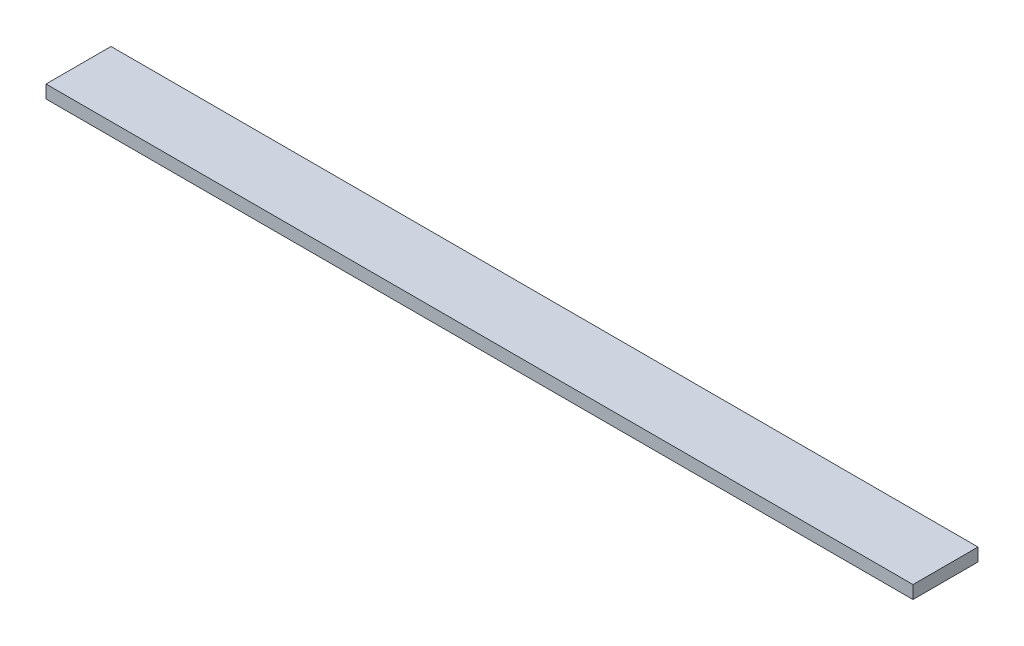
ISO-10303-21;
HEADER;
FILE_DESCRIPTION(('STEP AP214'),'2;1');
FILE_NAME('part.step','',(''),(''),'','','');
FILE_SCHEMA(('AUTOMOTIVE_DESIGN { 1 0 10303 214 1 1 1 1 }'));
ENDSEC;
DATA;
#1=APPLICATION_CONTEXT('core data for automotive mechanical design processes');
#2=APPLICATION_PROTOCOL_DEFINITION('international standard','automotive_design',2000,#1);
#3=PRODUCT_CONTEXT('',#1,'mechanical');
#4=PRODUCT('Part','Part','',(#3));
#5=PRODUCT_RELATED_PRODUCT_CATEGORY('part','',(#4));
#6=PRODUCT_DEFINITION_FORMATION('','',#4);
#7=PRODUCT_DEFINITION_CONTEXT('part definition',#1,'design');
#8=PRODUCT_DEFINITION('design','',#6,#7);
#9=PRODUCT_DEFINITION_SHAPE('','',#8);
#10=(LENGTH_UNIT() NAMED_UNIT(*) SI_UNIT(.MILLI.,.METRE.));
#11=(NAMED_UNIT(*) PLANE_ANGLE_UNIT() SI_UNIT($,.RADIAN.));
#12=(NAMED_UNIT(*) SI_UNIT($,.STERADIAN.) SOLID_ANGLE_UNIT());
#13=UNCERTAINTY_MEASURE_WITH_UNIT(LENGTH_MEASURE(1.E-05),#10,'distance_accuracy_value','');
#14=(GEOMETRIC_REPRESENTATION_CONTEXT(3) GLOBAL_UNCERTAINTY_ASSIGNED_CONTEXT((#13)) GLOBAL_UNIT_ASSIGNED_CONTEXT((#10,
#11,#12)) REPRESENTATION_CONTEXT('',''));
#15=CARTESIAN_POINT('',(0.,0.,0.));
#16=DIRECTION('',(0.,0.,1.));
#17=DIRECTION('',(1.,0.,0.));
#18=AXIS2_PLACEMENT_3D('',#15,#16,#17);
#19=CARTESIAN_POINT('',(200.,-1.5,-7.5));
#20=DIRECTION('',(0.,0.,1.));
#21=DIRECTION('',(1.,0.,0.));
#22=AXIS2_PLACEMENT_3D('',#19,#20,#21);
#23=PLANE('',#22);
#24=DIRECTION('',(0.,1.,0.));
#25=VECTOR('',#24,1.);
#26=CARTESIAN_POINT('',(0.,-1.5,-7.5));
#27=LINE('',#26,#25);
#28=CARTESIAN_POINT('',(0.,-1.5,-7.5));
#29=VERTEX_POINT('',#28);
#30=CARTESIAN_POINT('',(0.,1.5,-7.5));
#31=VERTEX_POINT('',#30);
#32=EDGE_CURVE('E98',#29,#31,#27,.T.);
#33=ORIENTED_EDGE('',*,*,#32,.T.);
#34=DIRECTION('',(-1.,0.,0.));
#35=VECTOR('',#34,1.);
#36=CARTESIAN_POINT('',(200.,1.5,-7.5));
#37=LINE('',#36,#35);
#38=CARTESIAN_POINT('',(200.,1.5,-7.5));
#39=VERTEX_POINT('',#38);
#40=EDGE_CURVE('E11',#39,#31,#37,.T.);
#41=ORIENTED_EDGE('',*,*,#40,.F.);
#42=DIRECTION('',(0.,1.,0.));
#43=VECTOR('',#42,1.);
#44=CARTESIAN_POINT('',(200.,-1.5,-7.5));
#45=LINE('',#44,#43);
#46=CARTESIAN_POINT('',(200.,-1.5,-7.5));
#47=VERTEX_POINT('',#46);
#48=EDGE_CURVE('E86',#47,#39,#45,.T.);
#49=ORIENTED_EDGE('',*,*,#48,.F.);
#50=DIRECTION('',(-1.,0.,0.));
#51=VECTOR('',#50,1.);
#52=CARTESIAN_POINT('',(200.,-1.5,-7.5));
#53=LINE('',#52,#51);
#54=EDGE_CURVE('E94',#47,#29,#53,.T.);
#55=ORIENTED_EDGE('',*,*,#54,.T.);
#56=EDGE_LOOP('',(#33,#41,#49,#55));
#57=FACE_BOUND('',#56,.T.);
#58=ADVANCED_FACE('F35',(#57),#23,.F.);
#59=CARTESIAN_POINT('',(200.,1.5,7.5));
#60=DIRECTION('',(0.,-1.,0.));
#61=DIRECTION('',(0.,0.,-1.));
#62=AXIS2_PLACEMENT_3D('',#59,#60,#61);
#63=PLANE('',#62);
#64=DIRECTION('',(0.,0.,1.));
#65=VECTOR('',#64,1.);
#66=CARTESIAN_POINT('',(0.,1.5,7.5));
#67=LINE('',#66,#65);
#68=CARTESIAN_POINT('',(0.,1.5,7.5));
#69=VERTEX_POINT('',#68);
#70=EDGE_CURVE('E90',#31,#69,#67,.T.);
#71=ORIENTED_EDGE('',*,*,#70,.T.);
#72=DIRECTION('',(-1.,0.,0.));
#73=VECTOR('',#72,1.);
#74=CARTESIAN_POINT('',(200.,1.5,7.5));
#75=LINE('',#74,#73);
#76=CARTESIAN_POINT('',(200.,1.5,7.5));
#77=VERTEX_POINT('',#76);
#78=EDGE_CURVE('E43',#77,#69,#75,.T.);
#79=ORIENTED_EDGE('',*,*,#78,.F.);
#80=DIRECTION('',(0.,0.,1.));
#81=VECTOR('',#80,1.);
#82=CARTESIAN_POINT('',(200.,1.5,7.5));
#83=LINE('',#82,#81);
#84=EDGE_CURVE('E81',#39,#77,#83,.T.);
#85=ORIENTED_EDGE('',*,*,#84,.F.);
#86=ORIENTED_EDGE('',*,*,#40,.T.);
#87=EDGE_LOOP('',(#71,#79,#85,#86));
#88=FACE_BOUND('',#87,.T.);
#89=ADVANCED_FACE('F89',(#88),#63,.F.);
#90=CARTESIAN_POINT('',(200.,-1.5,7.5));
#91=DIRECTION('',(0.,0.,-1.));
#92=DIRECTION('',(-1.,0.,0.));
#93=AXIS2_PLACEMENT_3D('',#90,#91,#92);
#94=PLANE('',#93);
#95=DIRECTION('',(0.,-1.,0.));
#96=VECTOR('',#95,1.);
#97=CARTESIAN_POINT('',(0.,-1.5,7.5));
#98=LINE('',#97,#96);
#99=CARTESIAN_POINT('',(0.,-1.5,7.5));
#100=VERTEX_POINT('',#99);
#101=EDGE_CURVE('E68',#69,#100,#98,.T.);
#102=ORIENTED_EDGE('',*,*,#101,.T.);
#103=DIRECTION('',(-1.,0.,0.));
#104=VECTOR('',#103,1.);
#105=CARTESIAN_POINT('',(200.,-1.5,7.5));
#106=LINE('',#105,#104);
#107=CARTESIAN_POINT('',(200.,-1.5,7.5));
#108=VERTEX_POINT('',#107);
#109=EDGE_CURVE('E91',#108,#100,#106,.T.);
#110=ORIENTED_EDGE('',*,*,#109,.F.);
#111=DIRECTION('',(0.,-1.,0.));
#112=VECTOR('',#111,1.);
#113=CARTESIAN_POINT('',(200.,-1.5,7.5));
#114=LINE('',#113,#112);
#115=EDGE_CURVE('E84',#77,#108,#114,.T.);
#116=ORIENTED_EDGE('',*,*,#115,.F.);
#117=ORIENTED_EDGE('',*,*,#78,.T.);
#118=EDGE_LOOP('',(#102,#110,#116,#117));
#119=FACE_BOUND('',#118,.T.);
#120=ADVANCED_FACE('F92',(#119),#94,.F.);
#121=CARTESIAN_POINT('',(200.,-1.5,7.5));
#122=DIRECTION('',(0.,1.,0.));
#123=DIRECTION('',(0.,0.,1.));
#124=AXIS2_PLACEMENT_3D('',#121,#122,#123);
#125=PLANE('',#124);
#126=DIRECTION('',(0.,0.,-1.));
#127=VECTOR('',#126,1.);
#128=CARTESIAN_POINT('',(0.,-1.5,7.5));
#129=LINE('',#128,#127);
#130=EDGE_CURVE('E74',#100,#29,#129,.T.);
#131=ORIENTED_EDGE('',*,*,#130,.T.);
#132=ORIENTED_EDGE('',*,*,#54,.F.);
#133=DIRECTION('',(0.,0.,-1.));
#134=VECTOR('',#133,1.);
#135=CARTESIAN_POINT('',(200.,-1.5,7.5));
#136=LINE('',#135,#134);
#137=EDGE_CURVE('E51',#108,#47,#136,.T.);
#138=ORIENTED_EDGE('',*,*,#137,.F.);
#139=ORIENTED_EDGE('',*,*,#109,.T.);
#140=EDGE_LOOP('',(#131,#132,#138,#139));
#141=FACE_BOUND('',#140,.T.);
#142=ADVANCED_FACE('F105',(#141),#125,.F.);
#143=CARTESIAN_POINT('',(200.,0.,0.));
#144=DIRECTION('',(-1.,0.,0.));
#145=DIRECTION('',(0.,0.,1.));
#146=AXIS2_PLACEMENT_3D('',#143,#144,#145);
#147=PLANE('',#146);
#148=ORIENTED_EDGE('',*,*,#48,.T.);
#149=ORIENTED_EDGE('',*,*,#84,.T.);
#150=ORIENTED_EDGE('',*,*,#115,.T.);
#151=ORIENTED_EDGE('',*,*,#137,.T.);
#152=EDGE_LOOP('',(#148,#149,#150,#151));
#153=FACE_BOUND('',#152,.T.);
#154=ADVANCED_FACE('F82',(#153),#147,.F.);
#155=CARTESIAN_POINT('',(0.,0.,0.));
#156=DIRECTION('',(-1.,0.,0.));
#157=DIRECTION('',(0.,0.,1.));
#158=AXIS2_PLACEMENT_3D('',#155,#156,#157);
#159=PLANE('',#158);
#160=ORIENTED_EDGE('',*,*,#32,.F.);
#161=ORIENTED_EDGE('',*,*,#130,.F.);
#162=ORIENTED_EDGE('',*,*,#101,.F.);
#163=ORIENTED_EDGE('',*,*,#70,.F.);
#164=EDGE_LOOP('',(#160,#161,#162,#163));
#165=FACE_BOUND('',#164,.T.);
#166=ADVANCED_FACE('F108',(#165),#159,.T.);
#167=CLOSED_SHELL('',(#58,#89,#120,#142,#154,#166));
#168=MANIFOLD_SOLID_BREP('B2',#167);
#169=ADVANCED_BREP_SHAPE_REPRESENTATION('',(#18,#168),#14);
#170=SHAPE_DEFINITION_REPRESENTATION(#9,#169);
ENDSEC;
END-ISO-10303-21;
